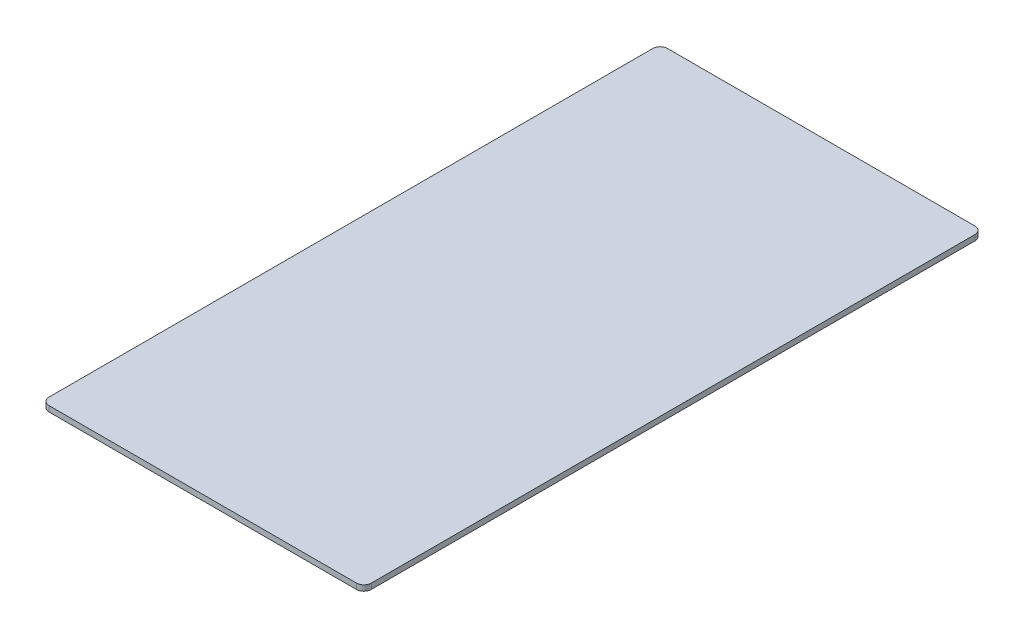
ISO-10303-21;
HEADER;
FILE_DESCRIPTION(('STEP AP214'),'2;1');
FILE_NAME('part.step','',(''),(''),'','','');
FILE_SCHEMA(('AUTOMOTIVE_DESIGN { 1 0 10303 214 1 1 1 1 }'));
ENDSEC;
DATA;
#1=APPLICATION_CONTEXT('core data for automotive mechanical design processes');
#2=APPLICATION_PROTOCOL_DEFINITION('international standard','automotive_design',2000,#1);
#3=PRODUCT_CONTEXT('',#1,'mechanical');
#4=PRODUCT('Part','Part','',(#3));
#5=PRODUCT_RELATED_PRODUCT_CATEGORY('part','',(#4));
#6=PRODUCT_DEFINITION_FORMATION('','',#4);
#7=PRODUCT_DEFINITION_CONTEXT('part definition',#1,'design');
#8=PRODUCT_DEFINITION('design','',#6,#7);
#9=PRODUCT_DEFINITION_SHAPE('','',#8);
#10=(LENGTH_UNIT() NAMED_UNIT(*) SI_UNIT(.MILLI.,.METRE.));
#11=(NAMED_UNIT(*) PLANE_ANGLE_UNIT() SI_UNIT($,.RADIAN.));
#12=(NAMED_UNIT(*) SI_UNIT($,.STERADIAN.) SOLID_ANGLE_UNIT());
#13=UNCERTAINTY_MEASURE_WITH_UNIT(LENGTH_MEASURE(1.E-05),#10,'distance_accuracy_value','');
#14=(GEOMETRIC_REPRESENTATION_CONTEXT(3) GLOBAL_UNCERTAINTY_ASSIGNED_CONTEXT((#13)) GLOBAL_UNIT_ASSIGNED_CONTEXT((#10,
#11,#12)) REPRESENTATION_CONTEXT('',''));
#15=CARTESIAN_POINT('',(0.,0.,0.));
#16=DIRECTION('',(0.,0.,1.));
#17=DIRECTION('',(1.,0.,0.));
#18=AXIS2_PLACEMENT_3D('',#15,#16,#17);
#19=CARTESIAN_POINT('',(-527.050000000001,95.25,-1035.05));
#20=DIRECTION('',(0.,-1.,0.));
#21=DIRECTION('',(0.,0.,-1.));
#22=AXIS2_PLACEMENT_3D('',#19,#20,#21);
#23=CYLINDRICAL_SURFACE('',#22,25.3999999999995);
#24=CARTESIAN_POINT('',(-527.050000000001,76.2,-1035.05));
#25=DIRECTION('',(0.,1.,0.));
#26=DIRECTION('',(0.,0.,1.));
#27=AXIS2_PLACEMENT_3D('',#24,#25,#26);
#28=CIRCLE('',#27,25.3999999999995);
#29=CARTESIAN_POINT('',(-552.45,76.2,-1035.05));
#30=VERTEX_POINT('',#29);
#31=CARTESIAN_POINT('',(-527.05,76.2,-1060.45));
#32=VERTEX_POINT('',#31);
#33=EDGE_CURVE('E133',#30,#32,#28,.F.);
#34=ORIENTED_EDGE('',*,*,#33,.F.);
#35=DIRECTION('',(0.,-1.,0.));
#36=VECTOR('',#35,1.);
#37=CARTESIAN_POINT('',(-552.45,95.25,-1035.05));
#38=LINE('',#37,#36);
#39=CARTESIAN_POINT('',(-552.45,95.25,-1035.05));
#40=VERTEX_POINT('',#39);
#41=EDGE_CURVE('E11',#40,#30,#38,.T.);
#42=ORIENTED_EDGE('',*,*,#41,.F.);
#43=CARTESIAN_POINT('',(-527.050000000001,95.25,-1035.05));
#44=DIRECTION('',(0.,1.,0.));
#45=DIRECTION('',(0.,0.,1.));
#46=AXIS2_PLACEMENT_3D('',#43,#44,#45);
#47=CIRCLE('',#46,25.3999999999995);
#48=CARTESIAN_POINT('',(-527.05,95.25,-1060.45));
#49=VERTEX_POINT('',#48);
#50=EDGE_CURVE('E153',#40,#49,#47,.F.);
#51=ORIENTED_EDGE('',*,*,#50,.T.);
#52=DIRECTION('',(0.,-1.,0.));
#53=VECTOR('',#52,1.);
#54=CARTESIAN_POINT('',(-527.05,95.25,-1060.45));
#55=LINE('',#54,#53);
#56=EDGE_CURVE('E56',#49,#32,#55,.T.);
#57=ORIENTED_EDGE('',*,*,#56,.T.);
#58=EDGE_LOOP('',(#34,#42,#51,#57));
#59=FACE_BOUND('',#58,.T.);
#60=ADVANCED_FACE('F40',(#59),#23,.T.);
#61=CARTESIAN_POINT('',(-552.45,95.25,0.));
#62=DIRECTION('',(-1.,0.,0.));
#63=DIRECTION('',(0.,0.,1.));
#64=AXIS2_PLACEMENT_3D('',#61,#62,#63);
#65=PLANE('',#64);
#66=DIRECTION('',(0.,0.,-1.));
#67=VECTOR('',#66,1.);
#68=CARTESIAN_POINT('',(-552.45,76.2,0.));
#69=LINE('',#68,#67);
#70=CARTESIAN_POINT('',(-552.45,76.2,1035.05));
#71=VERTEX_POINT('',#70);
#72=EDGE_CURVE('E135',#71,#30,#69,.T.);
#73=ORIENTED_EDGE('',*,*,#72,.F.);
#74=DIRECTION('',(0.,-1.,0.));
#75=VECTOR('',#74,1.);
#76=CARTESIAN_POINT('',(-552.45,95.25,1035.05));
#77=LINE('',#76,#75);
#78=CARTESIAN_POINT('',(-552.45,95.25,1035.05));
#79=VERTEX_POINT('',#78);
#80=EDGE_CURVE('E48',#79,#71,#77,.T.);
#81=ORIENTED_EDGE('',*,*,#80,.F.);
#82=DIRECTION('',(0.,0.,-1.));
#83=VECTOR('',#82,1.);
#84=CARTESIAN_POINT('',(-552.45,95.25,0.));
#85=LINE('',#84,#83);
#86=EDGE_CURVE('E179',#79,#40,#85,.T.);
#87=ORIENTED_EDGE('',*,*,#86,.T.);
#88=ORIENTED_EDGE('',*,*,#41,.T.);
#89=EDGE_LOOP('',(#73,#81,#87,#88));
#90=FACE_BOUND('',#89,.T.);
#91=ADVANCED_FACE('F170',(#90),#65,.T.);
#92=CARTESIAN_POINT('',(-527.050000000001,95.25,1035.05));
#93=DIRECTION('',(0.,-1.,0.));
#94=DIRECTION('',(0.,0.,-1.));
#95=AXIS2_PLACEMENT_3D('',#92,#93,#94);
#96=CYLINDRICAL_SURFACE('',#95,25.3999999999999);
#97=CARTESIAN_POINT('',(-527.050000000001,76.2,1035.05));
#98=DIRECTION('',(0.,1.,0.));
#99=DIRECTION('',(0.,0.,1.));
#100=AXIS2_PLACEMENT_3D('',#97,#98,#99);
#101=CIRCLE('',#100,25.3999999999999);
#102=CARTESIAN_POINT('',(-527.05,76.2,1060.45));
#103=VERTEX_POINT('',#102);
#104=EDGE_CURVE('E138',#103,#71,#101,.F.);
#105=ORIENTED_EDGE('',*,*,#104,.F.);
#106=DIRECTION('',(0.,-1.,0.));
#107=VECTOR('',#106,1.);
#108=CARTESIAN_POINT('',(-527.05,95.25,1060.45));
#109=LINE('',#108,#107);
#110=CARTESIAN_POINT('',(-527.05,95.25,1060.45));
#111=VERTEX_POINT('',#110);
#112=EDGE_CURVE('E159',#111,#103,#109,.T.);
#113=ORIENTED_EDGE('',*,*,#112,.F.);
#114=CARTESIAN_POINT('',(-527.050000000001,95.25,1035.05));
#115=DIRECTION('',(0.,1.,0.));
#116=DIRECTION('',(0.,0.,1.));
#117=AXIS2_PLACEMENT_3D('',#114,#115,#116);
#118=CIRCLE('',#117,25.3999999999999);
#119=EDGE_CURVE('E166',#111,#79,#118,.F.);
#120=ORIENTED_EDGE('',*,*,#119,.T.);
#121=ORIENTED_EDGE('',*,*,#80,.T.);
#122=EDGE_LOOP('',(#105,#113,#120,#121));
#123=FACE_BOUND('',#122,.T.);
#124=ADVANCED_FACE('F164',(#123),#96,.T.);
#125=CARTESIAN_POINT('',(4.46764446053979E-13,95.25,1060.45));
#126=DIRECTION('',(0.,0.,1.));
#127=DIRECTION('',(1.,0.,0.));
#128=AXIS2_PLACEMENT_3D('',#125,#126,#127);
#129=PLANE('',#128);
#130=DIRECTION('',(-1.,0.,0.));
#131=VECTOR('',#130,1.);
#132=CARTESIAN_POINT('',(4.46764446053979E-13,76.2,1060.45));
#133=LINE('',#132,#131);
#134=CARTESIAN_POINT('',(527.05,76.2,1060.45));
#135=VERTEX_POINT('',#134);
#136=EDGE_CURVE('E141',#135,#103,#133,.T.);
#137=ORIENTED_EDGE('',*,*,#136,.F.);
#138=DIRECTION('',(0.,-1.,0.));
#139=VECTOR('',#138,1.);
#140=CARTESIAN_POINT('',(527.05,95.25,1060.45));
#141=LINE('',#140,#139);
#142=CARTESIAN_POINT('',(527.05,95.25,1060.45));
#143=VERTEX_POINT('',#142);
#144=EDGE_CURVE('E157',#143,#135,#141,.T.);
#145=ORIENTED_EDGE('',*,*,#144,.F.);
#146=DIRECTION('',(-1.,0.,0.));
#147=VECTOR('',#146,1.);
#148=CARTESIAN_POINT('',(4.46764446053979E-13,95.25,1060.45));
#149=LINE('',#148,#147);
#150=EDGE_CURVE('E178',#143,#111,#149,.T.);
#151=ORIENTED_EDGE('',*,*,#150,.T.);
#152=ORIENTED_EDGE('',*,*,#112,.T.);
#153=EDGE_LOOP('',(#137,#145,#151,#152));
#154=FACE_BOUND('',#153,.T.);
#155=ADVANCED_FACE('F176',(#154),#129,.T.);
#156=CARTESIAN_POINT('',(527.049999999999,95.25,1035.05));
#157=DIRECTION('',(0.,-1.,0.));
#158=DIRECTION('',(0.,0.,-1.));
#159=AXIS2_PLACEMENT_3D('',#156,#157,#158);
#160=CYLINDRICAL_SURFACE('',#159,25.4000000000002);
#161=CARTESIAN_POINT('',(527.049999999999,76.2,1035.05));
#162=DIRECTION('',(0.,1.,0.));
#163=DIRECTION('',(0.,0.,1.));
#164=AXIS2_PLACEMENT_3D('',#161,#162,#163);
#165=CIRCLE('',#164,25.4000000000002);
#166=CARTESIAN_POINT('',(552.45,76.2,1035.05));
#167=VERTEX_POINT('',#166);
#168=EDGE_CURVE('E144',#167,#135,#165,.F.);
#169=ORIENTED_EDGE('',*,*,#168,.F.);
#170=DIRECTION('',(0.,-1.,0.));
#171=VECTOR('',#170,1.);
#172=CARTESIAN_POINT('',(552.45,95.25,1035.05));
#173=LINE('',#172,#171);
#174=CARTESIAN_POINT('',(552.45,95.25,1035.05));
#175=VERTEX_POINT('',#174);
#176=EDGE_CURVE('E115',#175,#167,#173,.T.);
#177=ORIENTED_EDGE('',*,*,#176,.F.);
#178=CARTESIAN_POINT('',(527.049999999999,95.25,1035.05));
#179=DIRECTION('',(0.,1.,0.));
#180=DIRECTION('',(0.,0.,1.));
#181=AXIS2_PLACEMENT_3D('',#178,#179,#180);
#182=CIRCLE('',#181,25.4000000000002);
#183=EDGE_CURVE('E125',#175,#143,#182,.F.);
#184=ORIENTED_EDGE('',*,*,#183,.T.);
#185=ORIENTED_EDGE('',*,*,#144,.T.);
#186=EDGE_LOOP('',(#169,#177,#184,#185));
#187=FACE_BOUND('',#186,.T.);
#188=ADVANCED_FACE('F185',(#187),#160,.T.);
#189=CARTESIAN_POINT('',(552.45,95.25,0.));
#190=DIRECTION('',(1.,0.,0.));
#191=DIRECTION('',(0.,0.,-1.));
#192=AXIS2_PLACEMENT_3D('',#189,#190,#191);
#193=PLANE('',#192);
#194=DIRECTION('',(0.,0.,1.));
#195=VECTOR('',#194,1.);
#196=CARTESIAN_POINT('',(552.45,76.2,0.));
#197=LINE('',#196,#195);
#198=CARTESIAN_POINT('',(552.45,76.2,-1035.05));
#199=VERTEX_POINT('',#198);
#200=EDGE_CURVE('E111',#199,#167,#197,.T.);
#201=ORIENTED_EDGE('',*,*,#200,.F.);
#202=DIRECTION('',(0.,-1.,0.));
#203=VECTOR('',#202,1.);
#204=CARTESIAN_POINT('',(552.45,95.25,-1035.05));
#205=LINE('',#204,#203);
#206=CARTESIAN_POINT('',(552.45,95.25,-1035.05));
#207=VERTEX_POINT('',#206);
#208=EDGE_CURVE('E106',#207,#199,#205,.T.);
#209=ORIENTED_EDGE('',*,*,#208,.F.);
#210=DIRECTION('',(0.,0.,1.));
#211=VECTOR('',#210,1.);
#212=CARTESIAN_POINT('',(552.45,95.25,0.));
#213=LINE('',#212,#211);
#214=EDGE_CURVE('E109',#207,#175,#213,.T.);
#215=ORIENTED_EDGE('',*,*,#214,.T.);
#216=ORIENTED_EDGE('',*,*,#176,.T.);
#217=EDGE_LOOP('',(#201,#209,#215,#216));
#218=FACE_BOUND('',#217,.T.);
#219=ADVANCED_FACE('F108',(#218),#193,.T.);
#220=CARTESIAN_POINT('',(527.05,95.25,-1035.05));
#221=DIRECTION('',(0.,-1.,0.));
#222=DIRECTION('',(0.,0.,-1.));
#223=AXIS2_PLACEMENT_3D('',#220,#221,#222);
#224=CYLINDRICAL_SURFACE('',#223,25.3999999999999);
#225=CARTESIAN_POINT('',(527.05,76.2,-1035.05));
#226=DIRECTION('',(0.,1.,0.));
#227=DIRECTION('',(0.,0.,1.));
#228=AXIS2_PLACEMENT_3D('',#225,#226,#227);
#229=CIRCLE('',#228,25.3999999999999);
#230=CARTESIAN_POINT('',(527.05,76.2,-1060.45));
#231=VERTEX_POINT('',#230);
#232=EDGE_CURVE('E148',#231,#199,#229,.F.);
#233=ORIENTED_EDGE('',*,*,#232,.F.);
#234=DIRECTION('',(0.,-1.,0.));
#235=VECTOR('',#234,1.);
#236=CARTESIAN_POINT('',(527.05,95.25,-1060.45));
#237=LINE('',#236,#235);
#238=CARTESIAN_POINT('',(527.05,95.25,-1060.45));
#239=VERTEX_POINT('',#238);
#240=EDGE_CURVE('E81',#239,#231,#237,.T.);
#241=ORIENTED_EDGE('',*,*,#240,.F.);
#242=CARTESIAN_POINT('',(527.05,95.25,-1035.05));
#243=DIRECTION('',(0.,1.,0.));
#244=DIRECTION('',(0.,0.,1.));
#245=AXIS2_PLACEMENT_3D('',#242,#243,#244);
#246=CIRCLE('',#245,25.3999999999999);
#247=EDGE_CURVE('E122',#239,#207,#246,.F.);
#248=ORIENTED_EDGE('',*,*,#247,.T.);
#249=ORIENTED_EDGE('',*,*,#208,.T.);
#250=EDGE_LOOP('',(#233,#241,#248,#249));
#251=FACE_BOUND('',#250,.T.);
#252=ADVANCED_FACE('F127',(#251),#224,.T.);
#253=CARTESIAN_POINT('',(0.,95.25,-1060.45));
#254=DIRECTION('',(0.,0.,-1.));
#255=DIRECTION('',(-1.,0.,0.));
#256=AXIS2_PLACEMENT_3D('',#253,#254,#255);
#257=PLANE('',#256);
#258=DIRECTION('',(1.,0.,0.));
#259=VECTOR('',#258,1.);
#260=CARTESIAN_POINT('',(0.,76.2,-1060.45));
#261=LINE('',#260,#259);
#262=EDGE_CURVE('E150',#32,#231,#261,.T.);
#263=ORIENTED_EDGE('',*,*,#262,.F.);
#264=ORIENTED_EDGE('',*,*,#56,.F.);
#265=DIRECTION('',(1.,0.,0.));
#266=VECTOR('',#265,1.);
#267=CARTESIAN_POINT('',(0.,95.25,-1060.45));
#268=LINE('',#267,#266);
#269=EDGE_CURVE('E128',#49,#239,#268,.T.);
#270=ORIENTED_EDGE('',*,*,#269,.T.);
#271=ORIENTED_EDGE('',*,*,#240,.T.);
#272=EDGE_LOOP('',(#263,#264,#270,#271));
#273=FACE_BOUND('',#272,.T.);
#274=ADVANCED_FACE('F186',(#273),#257,.T.);
#275=CARTESIAN_POINT('',(0.,95.25,0.));
#276=DIRECTION('',(0.,1.,0.));
#277=DIRECTION('',(0.,0.,1.));
#278=AXIS2_PLACEMENT_3D('',#275,#276,#277);
#279=PLANE('',#278);
#280=ORIENTED_EDGE('',*,*,#50,.F.);
#281=ORIENTED_EDGE('',*,*,#86,.F.);
#282=ORIENTED_EDGE('',*,*,#119,.F.);
#283=ORIENTED_EDGE('',*,*,#150,.F.);
#284=ORIENTED_EDGE('',*,*,#183,.F.);
#285=ORIENTED_EDGE('',*,*,#214,.F.);
#286=ORIENTED_EDGE('',*,*,#247,.F.);
#287=ORIENTED_EDGE('',*,*,#269,.F.);
#288=EDGE_LOOP('',(#280,#281,#282,#283,#284,#285,#286,#287));
#289=FACE_BOUND('',#288,.T.);
#290=ADVANCED_FACE('F120',(#289),#279,.T.);
#291=CARTESIAN_POINT('',(0.,76.2,0.));
#292=DIRECTION('',(0.,1.,0.));
#293=DIRECTION('',(0.,0.,1.));
#294=AXIS2_PLACEMENT_3D('',#291,#292,#293);
#295=PLANE('',#294);
#296=ORIENTED_EDGE('',*,*,#33,.T.);
#297=ORIENTED_EDGE('',*,*,#262,.T.);
#298=ORIENTED_EDGE('',*,*,#232,.T.);
#299=ORIENTED_EDGE('',*,*,#200,.T.);
#300=ORIENTED_EDGE('',*,*,#168,.T.);
#301=ORIENTED_EDGE('',*,*,#136,.T.);
#302=ORIENTED_EDGE('',*,*,#104,.T.);
#303=ORIENTED_EDGE('',*,*,#72,.T.);
#304=EDGE_LOOP('',(#296,#297,#298,#299,#300,#301,#302,#303));
#305=FACE_BOUND('',#304,.T.);
#306=ADVANCED_FACE('F172',(#305),#295,.F.);
#307=CLOSED_SHELL('',(#60,#91,#124,#155,#188,#219,#252,#274,#290,#306));
#308=MANIFOLD_SOLID_BREP('B2',#307);
#309=ADVANCED_BREP_SHAPE_REPRESENTATION('',(#18,#308),#14);
#310=SHAPE_DEFINITION_REPRESENTATION(#9,#309);
ENDSEC;
END-ISO-10303-21;
